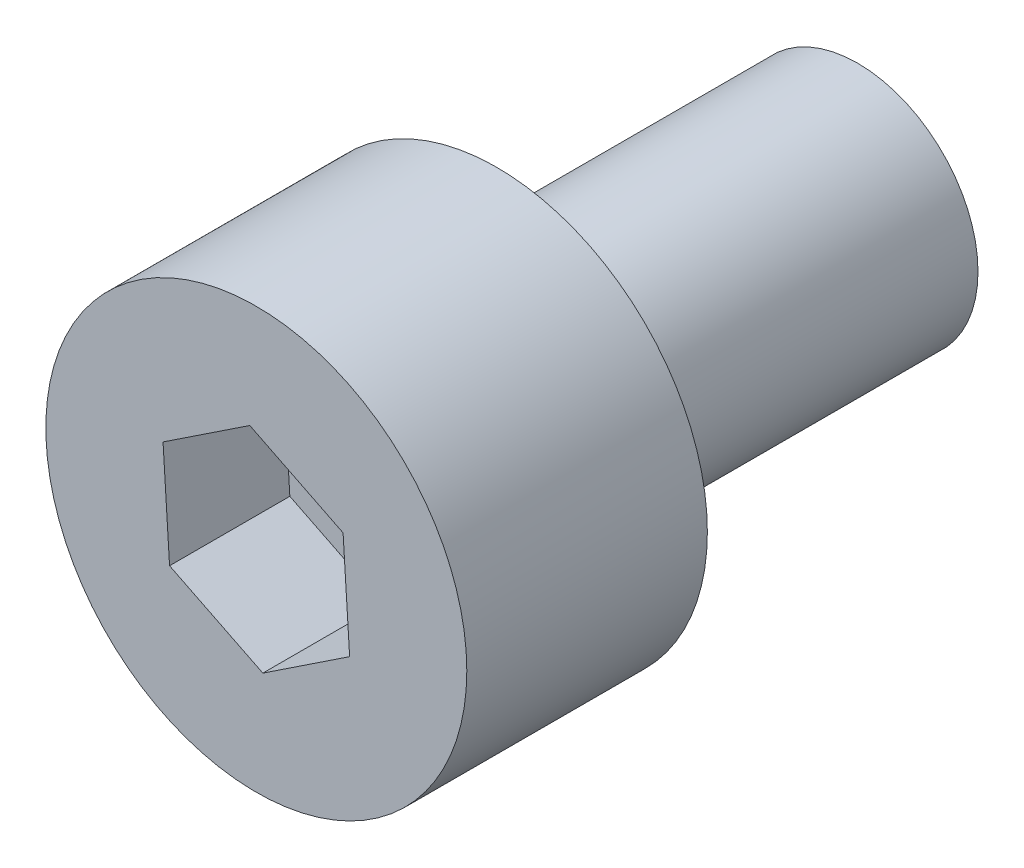
ISO-10303-21;
HEADER;
FILE_DESCRIPTION(('STEP AP214'),'2;1');
FILE_NAME('part.step','',(''),(''),'','','');
FILE_SCHEMA(('AUTOMOTIVE_DESIGN { 1 0 10303 214 1 1 1 1 }'));
ENDSEC;
DATA;
#1=APPLICATION_CONTEXT('core data for automotive mechanical design processes');
#2=APPLICATION_PROTOCOL_DEFINITION('international standard','automotive_design',2000,#1);
#3=PRODUCT_CONTEXT('',#1,'mechanical');
#4=PRODUCT('Part','Part','',(#3));
#5=PRODUCT_RELATED_PRODUCT_CATEGORY('part','',(#4));
#6=PRODUCT_DEFINITION_FORMATION('','',#4);
#7=PRODUCT_DEFINITION_CONTEXT('part definition',#1,'design');
#8=PRODUCT_DEFINITION('design','',#6,#7);
#9=PRODUCT_DEFINITION_SHAPE('','',#8);
#10=(LENGTH_UNIT() NAMED_UNIT(*) SI_UNIT(.MILLI.,.METRE.));
#11=(NAMED_UNIT(*) PLANE_ANGLE_UNIT() SI_UNIT($,.RADIAN.));
#12=(NAMED_UNIT(*) SI_UNIT($,.STERADIAN.) SOLID_ANGLE_UNIT());
#13=UNCERTAINTY_MEASURE_WITH_UNIT(LENGTH_MEASURE(1.E-05),#10,'distance_accuracy_value','');
#14=(GEOMETRIC_REPRESENTATION_CONTEXT(3) GLOBAL_UNCERTAINTY_ASSIGNED_CONTEXT((#13)) GLOBAL_UNIT_ASSIGNED_CONTEXT((#10,
#11,#12)) REPRESENTATION_CONTEXT('',''));
#15=CARTESIAN_POINT('',(0.,0.,0.));
#16=DIRECTION('',(0.,0.,1.));
#17=DIRECTION('',(1.,0.,0.));
#18=AXIS2_PLACEMENT_3D('',#15,#16,#17);
#19=CARTESIAN_POINT('',(0.,0.,4.));
#20=DIRECTION('',(0.,0.,-1.));
#21=DIRECTION('',(-1.,0.,0.));
#22=AXIS2_PLACEMENT_3D('',#19,#20,#21);
#23=CYLINDRICAL_SURFACE('',#22,3.5);
#24=CARTESIAN_POINT('',(0.,0.,4.));
#25=DIRECTION('',(0.,0.,1.));
#26=DIRECTION('',(1.,0.,0.));
#27=AXIS2_PLACEMENT_3D('',#24,#25,#26);
#28=CIRCLE('',#27,3.5);
#29=CARTESIAN_POINT('',(3.5,0.,4.));
#30=VERTEX_POINT('',#29);
#31=EDGE_CURVE('E44',#30,#30,#28,.T.);
#32=ORIENTED_EDGE('',*,*,#31,.F.);
#33=EDGE_LOOP('',(#32));
#34=FACE_BOUND('',#33,.T.);
#35=CARTESIAN_POINT('',(0.,0.,0.));
#36=DIRECTION('',(0.,0.,1.));
#37=DIRECTION('',(1.,0.,0.));
#38=AXIS2_PLACEMENT_3D('',#35,#36,#37);
#39=CIRCLE('',#38,3.5);
#40=CARTESIAN_POINT('',(3.5,0.,0.));
#41=VERTEX_POINT('',#40);
#42=EDGE_CURVE('E39',#41,#41,#39,.T.);
#43=ORIENTED_EDGE('',*,*,#42,.T.);
#44=EDGE_LOOP('',(#43));
#45=FACE_BOUND('',#44,.T.);
#46=ADVANCED_FACE('F36',(#34,#45),#23,.T.);
#47=CARTESIAN_POINT('',(0.,0.,4.));
#48=DIRECTION('',(0.,0.,1.));
#49=DIRECTION('',(1.,0.,0.));
#50=AXIS2_PLACEMENT_3D('',#47,#48,#49);
#51=PLANE('',#50);
#52=DIRECTION('',(0.832980374335627,0.553302535663519,0.));
#53=VECTOR('',#52,1.);
#54=CARTESIAN_POINT('',(0.108571638466755,-1.72864461336639,4.));
#55=LINE('',#54,#53);
#56=CARTESIAN_POINT('',(0.108571638466755,-1.72864461336639,4.));
#57=VERTEX_POINT('',#56);
#58=CARTESIAN_POINT('',(1.5513359685238,-0.770296509640489,4.));
#59=VERTEX_POINT('',#58);
#60=EDGE_CURVE('E52',#57,#59,#55,.T.);
#61=ORIENTED_EDGE('',*,*,#60,.F.);
#62=DIRECTION('',(0.895664239030766,-0.444730897196765,0.));
#63=VECTOR('',#62,1.);
#64=CARTESIAN_POINT('',(-1.44276433005705,-0.958348103725905,4.));
#65=LINE('',#64,#63);
#66=CARTESIAN_POINT('',(-1.44276433005705,-0.958348103725905,4.));
#67=VERTEX_POINT('',#66);
#68=EDGE_CURVE('E136',#67,#57,#65,.T.);
#69=ORIENTED_EDGE('',*,*,#68,.F.);
#70=DIRECTION('',(0.0626838646951394,-0.998033432860283,0.));
#71=VECTOR('',#70,1.);
#72=CARTESIAN_POINT('',(-1.5513359685238,0.770296509640488,4.));
#73=LINE('',#72,#71);
#74=CARTESIAN_POINT('',(-1.5513359685238,0.770296509640488,4.));
#75=VERTEX_POINT('',#74);
#76=EDGE_CURVE('E134',#75,#67,#73,.T.);
#77=ORIENTED_EDGE('',*,*,#76,.F.);
#78=DIRECTION('',(-0.832980374335627,-0.553302535663518,0.));
#79=VECTOR('',#78,1.);
#80=CARTESIAN_POINT('',(-0.108571638466753,1.72864461336639,4.));
#81=LINE('',#80,#79);
#82=CARTESIAN_POINT('',(-0.108571638466753,1.72864461336639,4.));
#83=VERTEX_POINT('',#82);
#84=EDGE_CURVE('E100',#83,#75,#81,.T.);
#85=ORIENTED_EDGE('',*,*,#84,.F.);
#86=DIRECTION('',(-0.895664239030766,0.444730897196765,0.));
#87=VECTOR('',#86,1.);
#88=CARTESIAN_POINT('',(1.44276433005705,0.958348103725905,4.));
#89=LINE('',#88,#87);
#90=CARTESIAN_POINT('',(1.44276433005705,0.958348103725905,4.));
#91=VERTEX_POINT('',#90);
#92=EDGE_CURVE('E130',#91,#83,#89,.T.);
#93=ORIENTED_EDGE('',*,*,#92,.F.);
#94=DIRECTION('',(-0.0626838646951393,0.998033432860283,0.));
#95=VECTOR('',#94,1.);
#96=CARTESIAN_POINT('',(1.5513359685238,-0.770296509640488,4.));
#97=LINE('',#96,#95);
#98=EDGE_CURVE('E126',#59,#91,#97,.T.);
#99=ORIENTED_EDGE('',*,*,#98,.F.);
#100=EDGE_LOOP('',(#61,#69,#77,#85,#93,#99));
#101=FACE_BOUND('',#100,.T.);
#102=ORIENTED_EDGE('',*,*,#31,.T.);
#103=EDGE_LOOP('',(#102));
#104=FACE_BOUND('',#103,.T.);
#105=ADVANCED_FACE('F154',(#101,#104),#51,.T.);
#106=CARTESIAN_POINT('',(0.,0.,0.));
#107=DIRECTION('',(0.,0.,1.));
#108=DIRECTION('',(1.,0.,0.));
#109=AXIS2_PLACEMENT_3D('',#106,#107,#108);
#110=PLANE('',#109);
#111=CARTESIAN_POINT('',(0.,0.,0.));
#112=DIRECTION('',(0.,0.,-1.));
#113=DIRECTION('',(-1.,0.,0.));
#114=AXIS2_PLACEMENT_3D('',#111,#112,#113);
#115=CIRCLE('',#114,2.);
#116=CARTESIAN_POINT('',(-2.,0.,0.));
#117=VERTEX_POINT('',#116);
#118=EDGE_CURVE('E11',#117,#117,#115,.T.);
#119=ORIENTED_EDGE('',*,*,#118,.F.);
#120=EDGE_LOOP('',(#119));
#121=FACE_BOUND('',#120,.T.);
#122=ORIENTED_EDGE('',*,*,#42,.F.);
#123=EDGE_LOOP('',(#122));
#124=FACE_BOUND('',#123,.T.);
#125=ADVANCED_FACE('F151',(#121,#124),#110,.F.);
#126=CARTESIAN_POINT('',(0.108571638466755,-1.72864461336639,2.));
#127=DIRECTION('',(0.553302535663519,-0.832980374335627,0.));
#128=DIRECTION('',(0.832980374335627,0.553302535663519,0.));
#129=AXIS2_PLACEMENT_3D('',#126,#127,#128);
#130=PLANE('',#129);
#131=ORIENTED_EDGE('',*,*,#60,.T.);
#132=DIRECTION('',(0.,0.,1.));
#133=VECTOR('',#132,1.);
#134=CARTESIAN_POINT('',(1.5513359685238,-0.770296509640488,2.));
#135=LINE('',#134,#133);
#136=CARTESIAN_POINT('',(1.5513359685238,-0.770296509640488,2.));
#137=VERTEX_POINT('',#136);
#138=EDGE_CURVE('E82',#137,#59,#135,.T.);
#139=ORIENTED_EDGE('',*,*,#138,.F.);
#140=DIRECTION('',(0.832980374335627,0.553302535663519,0.));
#141=VECTOR('',#140,1.);
#142=CARTESIAN_POINT('',(0.108571638466755,-1.72864461336639,2.));
#143=LINE('',#142,#141);
#144=CARTESIAN_POINT('',(0.108571638466755,-1.72864461336639,2.));
#145=VERTEX_POINT('',#144);
#146=EDGE_CURVE('E138',#145,#137,#143,.T.);
#147=ORIENTED_EDGE('',*,*,#146,.F.);
#148=DIRECTION('',(0.,0.,1.));
#149=VECTOR('',#148,1.);
#150=CARTESIAN_POINT('',(0.108571638466755,-1.72864461336639,2.));
#151=LINE('',#150,#149);
#152=EDGE_CURVE('E60',#145,#57,#151,.T.);
#153=ORIENTED_EDGE('',*,*,#152,.T.);
#154=EDGE_LOOP('',(#131,#139,#147,#153));
#155=FACE_BOUND('',#154,.T.);
#156=ADVANCED_FACE('F153',(#155),#130,.F.);
#157=CARTESIAN_POINT('',(-1.44276433005705,-0.958348103725905,2.));
#158=DIRECTION('',(-0.444730897196765,-0.895664239030766,0.));
#159=DIRECTION('',(0.895664239030766,-0.444730897196765,0.));
#160=AXIS2_PLACEMENT_3D('',#157,#158,#159);
#161=PLANE('',#160);
#162=ORIENTED_EDGE('',*,*,#68,.T.);
#163=ORIENTED_EDGE('',*,*,#152,.F.);
#164=DIRECTION('',(0.895664239030766,-0.444730897196765,0.));
#165=VECTOR('',#164,1.);
#166=CARTESIAN_POINT('',(-1.44276433005705,-0.958348103725905,2.));
#167=LINE('',#166,#165);
#168=CARTESIAN_POINT('',(-1.44276433005705,-0.958348103725905,2.));
#169=VERTEX_POINT('',#168);
#170=EDGE_CURVE('E112',#169,#145,#167,.T.);
#171=ORIENTED_EDGE('',*,*,#170,.F.);
#172=DIRECTION('',(0.,0.,1.));
#173=VECTOR('',#172,1.);
#174=CARTESIAN_POINT('',(-1.44276433005705,-0.958348103725905,2.));
#175=LINE('',#174,#173);
#176=EDGE_CURVE('E104',#169,#67,#175,.T.);
#177=ORIENTED_EDGE('',*,*,#176,.T.);
#178=EDGE_LOOP('',(#162,#163,#171,#177));
#179=FACE_BOUND('',#178,.T.);
#180=ADVANCED_FACE('F160',(#179),#161,.F.);
#181=CARTESIAN_POINT('',(-1.5513359685238,0.770296509640488,2.));
#182=DIRECTION('',(-0.998033432860283,-0.0626838646951395,0.));
#183=DIRECTION('',(0.0626838646951395,-0.998033432860283,0.));
#184=AXIS2_PLACEMENT_3D('',#181,#182,#183);
#185=PLANE('',#184);
#186=ORIENTED_EDGE('',*,*,#76,.T.);
#187=ORIENTED_EDGE('',*,*,#176,.F.);
#188=DIRECTION('',(0.0626838646951394,-0.998033432860283,0.));
#189=VECTOR('',#188,1.);
#190=CARTESIAN_POINT('',(-1.5513359685238,0.770296509640488,2.));
#191=LINE('',#190,#189);
#192=CARTESIAN_POINT('',(-1.5513359685238,0.770296509640488,2.));
#193=VERTEX_POINT('',#192);
#194=EDGE_CURVE('E108',#193,#169,#191,.T.);
#195=ORIENTED_EDGE('',*,*,#194,.F.);
#196=DIRECTION('',(0.,0.,1.));
#197=VECTOR('',#196,1.);
#198=CARTESIAN_POINT('',(-1.5513359685238,0.770296509640488,2.));
#199=LINE('',#198,#197);
#200=EDGE_CURVE('E93',#193,#75,#199,.T.);
#201=ORIENTED_EDGE('',*,*,#200,.T.);
#202=EDGE_LOOP('',(#186,#187,#195,#201));
#203=FACE_BOUND('',#202,.T.);
#204=ADVANCED_FACE('F109',(#203),#185,.F.);
#205=CARTESIAN_POINT('',(-0.108571638466753,1.72864461336639,2.));
#206=DIRECTION('',(-0.553302535663519,0.832980374335627,0.));
#207=DIRECTION('',(-0.832980374335627,-0.553302535663519,0.));
#208=AXIS2_PLACEMENT_3D('',#205,#206,#207);
#209=PLANE('',#208);
#210=ORIENTED_EDGE('',*,*,#84,.T.);
#211=ORIENTED_EDGE('',*,*,#200,.F.);
#212=DIRECTION('',(-0.832980374335627,-0.553302535663518,0.));
#213=VECTOR('',#212,1.);
#214=CARTESIAN_POINT('',(-0.108571638466753,1.72864461336639,2.));
#215=LINE('',#214,#213);
#216=CARTESIAN_POINT('',(-0.108571638466753,1.72864461336639,2.));
#217=VERTEX_POINT('',#216);
#218=EDGE_CURVE('E97',#217,#193,#215,.T.);
#219=ORIENTED_EDGE('',*,*,#218,.F.);
#220=DIRECTION('',(0.,0.,1.));
#221=VECTOR('',#220,1.);
#222=CARTESIAN_POINT('',(-0.108571638466753,1.72864461336639,2.));
#223=LINE('',#222,#221);
#224=EDGE_CURVE('E105',#217,#83,#223,.T.);
#225=ORIENTED_EDGE('',*,*,#224,.T.);
#226=EDGE_LOOP('',(#210,#211,#219,#225));
#227=FACE_BOUND('',#226,.T.);
#228=ADVANCED_FACE('F95',(#227),#209,.F.);
#229=CARTESIAN_POINT('',(1.44276433005705,0.958348103725905,2.));
#230=DIRECTION('',(0.444730897196765,0.895664239030766,0.));
#231=DIRECTION('',(-0.895664239030766,0.444730897196765,0.));
#232=AXIS2_PLACEMENT_3D('',#229,#230,#231);
#233=PLANE('',#232);
#234=ORIENTED_EDGE('',*,*,#92,.T.);
#235=ORIENTED_EDGE('',*,*,#224,.F.);
#236=DIRECTION('',(-0.895664239030766,0.444730897196765,0.));
#237=VECTOR('',#236,1.);
#238=CARTESIAN_POINT('',(1.44276433005705,0.958348103725905,2.));
#239=LINE('',#238,#237);
#240=CARTESIAN_POINT('',(1.44276433005705,0.958348103725905,2.));
#241=VERTEX_POINT('',#240);
#242=EDGE_CURVE('E118',#241,#217,#239,.T.);
#243=ORIENTED_EDGE('',*,*,#242,.F.);
#244=DIRECTION('',(0.,0.,1.));
#245=VECTOR('',#244,1.);
#246=CARTESIAN_POINT('',(1.44276433005705,0.958348103725905,2.));
#247=LINE('',#246,#245);
#248=EDGE_CURVE('E142',#241,#91,#247,.T.);
#249=ORIENTED_EDGE('',*,*,#248,.T.);
#250=EDGE_LOOP('',(#234,#235,#243,#249));
#251=FACE_BOUND('',#250,.T.);
#252=ADVANCED_FACE('F205',(#251),#233,.F.);
#253=CARTESIAN_POINT('',(1.5513359685238,-0.770296509640488,2.));
#254=DIRECTION('',(0.998033432860283,0.0626838646951393,0.));
#255=DIRECTION('',(-0.0626838646951393,0.998033432860283,0.));
#256=AXIS2_PLACEMENT_3D('',#253,#254,#255);
#257=PLANE('',#256);
#258=ORIENTED_EDGE('',*,*,#98,.T.);
#259=ORIENTED_EDGE('',*,*,#248,.F.);
#260=DIRECTION('',(-0.0626838646951393,0.998033432860283,0.));
#261=VECTOR('',#260,1.);
#262=CARTESIAN_POINT('',(1.5513359685238,-0.770296509640488,2.));
#263=LINE('',#262,#261);
#264=EDGE_CURVE('E120',#137,#241,#263,.T.);
#265=ORIENTED_EDGE('',*,*,#264,.F.);
#266=ORIENTED_EDGE('',*,*,#138,.T.);
#267=EDGE_LOOP('',(#258,#259,#265,#266));
#268=FACE_BOUND('',#267,.T.);
#269=ADVANCED_FACE('F214',(#268),#257,.F.);
#270=CARTESIAN_POINT('',(0.,0.,2.));
#271=DIRECTION('',(0.,0.,1.));
#272=DIRECTION('',(1.,0.,0.));
#273=AXIS2_PLACEMENT_3D('',#270,#271,#272);
#274=PLANE('',#273);
#275=ORIENTED_EDGE('',*,*,#146,.T.);
#276=ORIENTED_EDGE('',*,*,#264,.T.);
#277=ORIENTED_EDGE('',*,*,#242,.T.);
#278=ORIENTED_EDGE('',*,*,#218,.T.);
#279=ORIENTED_EDGE('',*,*,#194,.T.);
#280=ORIENTED_EDGE('',*,*,#170,.T.);
#281=EDGE_LOOP('',(#275,#276,#277,#278,#279,#280));
#282=FACE_BOUND('',#281,.T.);
#283=ADVANCED_FACE('F115',(#282),#274,.T.);
#284=CARTESIAN_POINT('',(0.,0.,-6.));
#285=DIRECTION('',(0.,0.,1.));
#286=DIRECTION('',(1.,0.,0.));
#287=AXIS2_PLACEMENT_3D('',#284,#285,#286);
#288=CYLINDRICAL_SURFACE('',#287,2.);
#289=CARTESIAN_POINT('',(0.,0.,-6.));
#290=DIRECTION('',(0.,0.,-1.));
#291=DIRECTION('',(-1.,0.,0.));
#292=AXIS2_PLACEMENT_3D('',#289,#290,#291);
#293=CIRCLE('',#292,2.);
#294=CARTESIAN_POINT('',(-2.,0.,-6.));
#295=VERTEX_POINT('',#294);
#296=EDGE_CURVE('E127',#295,#295,#293,.T.);
#297=ORIENTED_EDGE('',*,*,#296,.F.);
#298=EDGE_LOOP('',(#297));
#299=FACE_BOUND('',#298,.T.);
#300=ORIENTED_EDGE('',*,*,#118,.T.);
#301=EDGE_LOOP('',(#300));
#302=FACE_BOUND('',#301,.T.);
#303=ADVANCED_FACE('F232',(#299,#302),#288,.T.);
#304=CARTESIAN_POINT('',(0.,0.,-6.));
#305=DIRECTION('',(0.,0.,-1.));
#306=DIRECTION('',(-1.,0.,0.));
#307=AXIS2_PLACEMENT_3D('',#304,#305,#306);
#308=PLANE('',#307);
#309=ORIENTED_EDGE('',*,*,#296,.T.);
#310=EDGE_LOOP('',(#309));
#311=FACE_BOUND('',#310,.T.);
#312=ADVANCED_FACE('F245',(#311),#308,.T.);
#313=CLOSED_SHELL('',(#46,#105,#125,#156,#180,#204,#228,#252,#269,#283,#303,#312));
#314=MANIFOLD_SOLID_BREP('B2',#313);
#315=ADVANCED_BREP_SHAPE_REPRESENTATION('',(#18,#314),#14);
#316=SHAPE_DEFINITION_REPRESENTATION(#9,#315);
ENDSEC;
END-ISO-10303-21;
